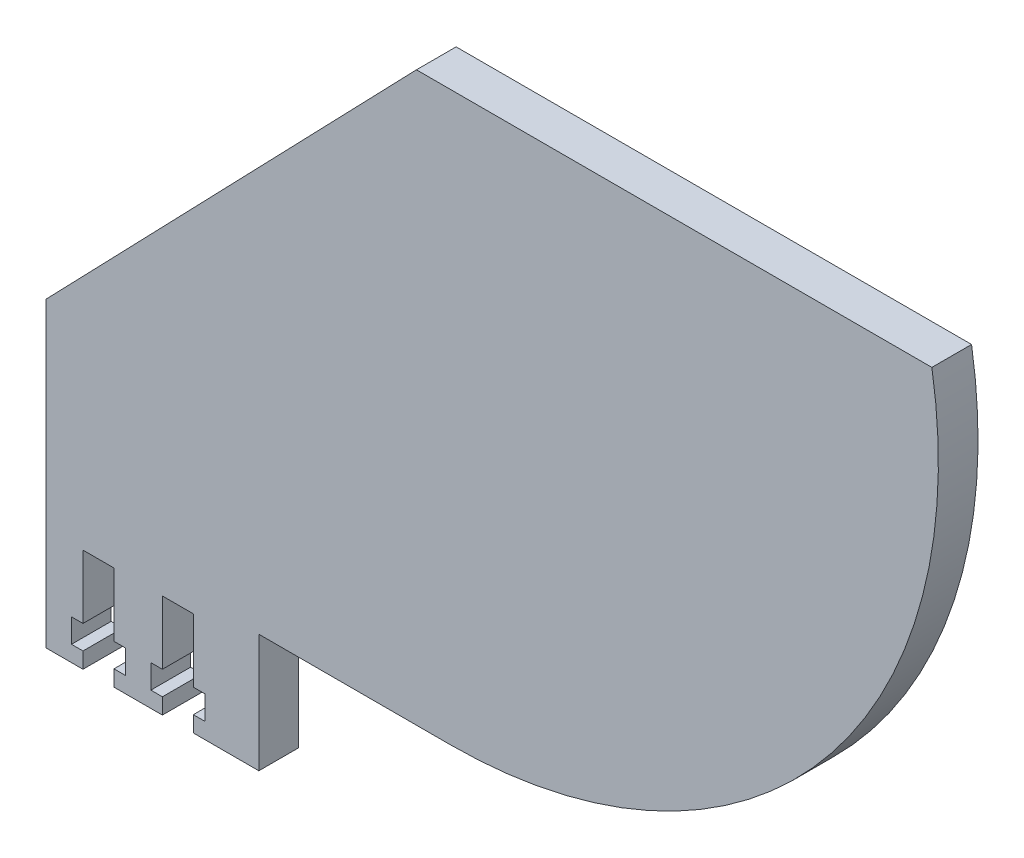
ISO-10303-21;
HEADER;
FILE_DESCRIPTION(('STEP AP214'),'2;1');
FILE_NAME('part.step','',(''),(''),'','','');
FILE_SCHEMA(('AUTOMOTIVE_DESIGN { 1 0 10303 214 1 1 1 1 }'));
ENDSEC;
DATA;
#1=APPLICATION_CONTEXT('core data for automotive mechanical design processes');
#2=APPLICATION_PROTOCOL_DEFINITION('international standard','automotive_design',2000,#1);
#3=PRODUCT_CONTEXT('',#1,'mechanical');
#4=PRODUCT('Part','Part','',(#3));
#5=PRODUCT_RELATED_PRODUCT_CATEGORY('part','',(#4));
#6=PRODUCT_DEFINITION_FORMATION('','',#4);
#7=PRODUCT_DEFINITION_CONTEXT('part definition',#1,'design');
#8=PRODUCT_DEFINITION('design','',#6,#7);
#9=PRODUCT_DEFINITION_SHAPE('','',#8);
#10=(LENGTH_UNIT() NAMED_UNIT(*) SI_UNIT(.MILLI.,.METRE.));
#11=(NAMED_UNIT(*) PLANE_ANGLE_UNIT() SI_UNIT($,.RADIAN.));
#12=(NAMED_UNIT(*) SI_UNIT($,.STERADIAN.) SOLID_ANGLE_UNIT());
#13=UNCERTAINTY_MEASURE_WITH_UNIT(LENGTH_MEASURE(1.E-05),#10,'distance_accuracy_value','');
#14=(GEOMETRIC_REPRESENTATION_CONTEXT(3) GLOBAL_UNCERTAINTY_ASSIGNED_CONTEXT((#13)) GLOBAL_UNIT_ASSIGNED_CONTEXT((#10,
#11,#12)) REPRESENTATION_CONTEXT('',''));
#15=CARTESIAN_POINT('',(0.,0.,0.));
#16=DIRECTION('',(0.,0.,1.));
#17=DIRECTION('',(1.,0.,0.));
#18=AXIS2_PLACEMENT_3D('',#15,#16,#17);
#19=CARTESIAN_POINT('',(-227.4824256817,-83.8915758699051,5.));
#20=DIRECTION('',(0.,1.,0.));
#21=DIRECTION('',(-1.,0.,0.));
#22=AXIS2_PLACEMENT_3D('',#19,#20,#21);
#23=PLANE('',#22);
#24=DIRECTION('',(1.,0.,0.));
#25=VECTOR('',#24,1.);
#26=CARTESIAN_POINT('',(-227.4824256817,-83.8915758699051,0.));
#27=LINE('',#26,#25);
#28=CARTESIAN_POINT('',(-218.9224256817,-83.8915758699051,0.));
#29=VERTEX_POINT('',#28);
#30=CARTESIAN_POINT('',(-212.8224256817,-83.8915758699051,0.));
#31=VERTEX_POINT('',#30);
#32=EDGE_CURVE('E256',#29,#31,#27,.T.);
#33=ORIENTED_EDGE('',*,*,#32,.T.);
#34=DIRECTION('',(0.,0.,1.));
#35=VECTOR('',#34,1.);
#36=CARTESIAN_POINT('',(-212.8224256817,-83.8915758699051,0.));
#37=LINE('',#36,#35);
#38=CARTESIAN_POINT('',(-212.8224256817,-83.8915758699051,5.));
#39=VERTEX_POINT('',#38);
#40=EDGE_CURVE('E238',#31,#39,#37,.T.);
#41=ORIENTED_EDGE('',*,*,#40,.T.);
#42=DIRECTION('',(1.,0.,0.));
#43=VECTOR('',#42,1.);
#44=CARTESIAN_POINT('',(-227.4824256817,-83.8915758699051,5.));
#45=LINE('',#44,#43);
#46=CARTESIAN_POINT('',(-218.9224256817,-83.8915758699051,5.));
#47=VERTEX_POINT('',#46);
#48=EDGE_CURVE('E346',#47,#39,#45,.T.);
#49=ORIENTED_EDGE('',*,*,#48,.F.);
#50=DIRECTION('',(0.,0.,1.));
#51=VECTOR('',#50,1.);
#52=CARTESIAN_POINT('',(-218.9224256817,-83.8915758699051,0.));
#53=LINE('',#52,#51);
#54=EDGE_CURVE('E263',#29,#47,#53,.T.);
#55=ORIENTED_EDGE('',*,*,#54,.F.);
#56=EDGE_LOOP('',(#33,#41,#49,#55));
#57=FACE_BOUND('',#56,.T.);
#58=ADVANCED_FACE('F35',(#57),#23,.F.);
#59=CARTESIAN_POINT('',(-227.4824256817,-83.8915758699051,0.));
#60=VERTEX_POINT('',#59);
#61=CARTESIAN_POINT('',(-222.8224256817,-83.8915758699051,0.));
#62=VERTEX_POINT('',#61);
#63=EDGE_CURVE('E264',#60,#62,#27,.T.);
#64=ORIENTED_EDGE('',*,*,#63,.T.);
#65=DIRECTION('',(0.,0.,1.));
#66=VECTOR('',#65,1.);
#67=CARTESIAN_POINT('',(-222.8224256817,-83.8915758699051,0.));
#68=LINE('',#67,#66);
#69=CARTESIAN_POINT('',(-222.8224256817,-83.8915758699051,5.));
#70=VERTEX_POINT('',#69);
#71=EDGE_CURVE('E350',#62,#70,#68,.T.);
#72=ORIENTED_EDGE('',*,*,#71,.T.);
#73=CARTESIAN_POINT('',(-227.4824256817,-83.8915758699051,5.));
#74=VERTEX_POINT('',#73);
#75=EDGE_CURVE('E348',#74,#70,#45,.T.);
#76=ORIENTED_EDGE('',*,*,#75,.F.);
#77=DIRECTION('',(0.,0.,-1.));
#78=VECTOR('',#77,1.);
#79=CARTESIAN_POINT('',(-227.4824256817,-83.8915758699051,5.));
#80=LINE('',#79,#78);
#81=EDGE_CURVE('E11',#74,#60,#80,.T.);
#82=ORIENTED_EDGE('',*,*,#81,.T.);
#83=EDGE_LOOP('',(#64,#72,#76,#82));
#84=FACE_BOUND('',#83,.T.);
#85=ADVANCED_FACE('F450',(#84),#23,.F.);
#86=CARTESIAN_POINT('',(-227.4824256817,-83.8915758699051,5.));
#87=DIRECTION('',(1.,0.,0.));
#88=DIRECTION('',(0.,0.,-1.));
#89=AXIS2_PLACEMENT_3D('',#86,#87,#88);
#90=PLANE('',#89);
#91=DIRECTION('',(0.,-1.,0.));
#92=VECTOR('',#91,1.);
#93=CARTESIAN_POINT('',(-227.4824256817,-83.8915758699051,0.));
#94=LINE('',#93,#92);
#95=CARTESIAN_POINT('',(-227.4824256817,-45.8486887400731,0.));
#96=VERTEX_POINT('',#95);
#97=EDGE_CURVE('E269',#96,#60,#94,.T.);
#98=ORIENTED_EDGE('',*,*,#97,.T.);
#99=ORIENTED_EDGE('',*,*,#81,.F.);
#100=DIRECTION('',(0.,-1.,0.));
#101=VECTOR('',#100,1.);
#102=CARTESIAN_POINT('',(-227.4824256817,-83.8915758699051,5.));
#103=LINE('',#102,#101);
#104=CARTESIAN_POINT('',(-227.4824256817,-45.8486887400731,5.));
#105=VERTEX_POINT('',#104);
#106=EDGE_CURVE('E282',#105,#74,#103,.T.);
#107=ORIENTED_EDGE('',*,*,#106,.F.);
#108=DIRECTION('',(0.,0.,-1.));
#109=VECTOR('',#108,1.);
#110=CARTESIAN_POINT('',(-227.4824256817,-45.8486887400731,5.));
#111=LINE('',#110,#109);
#112=EDGE_CURVE('E283',#105,#96,#111,.T.);
#113=ORIENTED_EDGE('',*,*,#112,.T.);
#114=EDGE_LOOP('',(#98,#99,#107,#113));
#115=FACE_BOUND('',#114,.T.);
#116=ADVANCED_FACE('F37',(#115),#90,.F.);
#117=CARTESIAN_POINT('',(-208.9224256817,-83.8915758699051,5.));
#118=VERTEX_POINT('',#117);
#119=CARTESIAN_POINT('',(-200.672425681694,-83.8915758699053,5.));
#120=VERTEX_POINT('',#119);
#121=EDGE_CURVE('E344',#118,#120,#45,.T.);
#122=ORIENTED_EDGE('',*,*,#121,.F.);
#123=DIRECTION('',(0.,0.,1.));
#124=VECTOR('',#123,1.);
#125=CARTESIAN_POINT('',(-208.9224256817,-83.8915758699051,0.));
#126=LINE('',#125,#124);
#127=CARTESIAN_POINT('',(-208.9224256817,-83.8915758699051,0.));
#128=VERTEX_POINT('',#127);
#129=EDGE_CURVE('E249',#128,#118,#126,.T.);
#130=ORIENTED_EDGE('',*,*,#129,.F.);
#131=CARTESIAN_POINT('',(-200.672425681694,-83.8915758699053,0.));
#132=VERTEX_POINT('',#131);
#133=EDGE_CURVE('E265',#128,#132,#27,.T.);
#134=ORIENTED_EDGE('',*,*,#133,.T.);
#135=DIRECTION('',(0.,0.,-1.));
#136=VECTOR('',#135,1.);
#137=CARTESIAN_POINT('',(-200.672425681694,-83.8915758699053,5.));
#138=LINE('',#137,#136);
#139=EDGE_CURVE('E43',#120,#132,#138,.T.);
#140=ORIENTED_EDGE('',*,*,#139,.F.);
#141=EDGE_LOOP('',(#122,#130,#134,#140));
#142=FACE_BOUND('',#141,.T.);
#143=ADVANCED_FACE('F357',(#142),#23,.F.);
#144=CARTESIAN_POINT('',(-200.672425681694,-83.8915758699053,5.));
#145=DIRECTION('',(-1.,0.,0.));
#146=DIRECTION('',(0.,-1.,0.));
#147=AXIS2_PLACEMENT_3D('',#144,#145,#146);
#148=PLANE('',#147);
#149=DIRECTION('',(0.,1.,0.));
#150=VECTOR('',#149,1.);
#151=CARTESIAN_POINT('',(-200.672425681694,-83.8915758699053,0.));
#152=LINE('',#151,#150);
#153=CARTESIAN_POINT('',(-200.672425681694,-68.9915758699057,0.));
#154=VERTEX_POINT('',#153);
#155=EDGE_CURVE('E268',#132,#154,#152,.T.);
#156=ORIENTED_EDGE('',*,*,#155,.T.);
#157=DIRECTION('',(0.,0.,-1.));
#158=VECTOR('',#157,1.);
#159=CARTESIAN_POINT('',(-200.672425681694,-68.9915758699057,5.));
#160=LINE('',#159,#158);
#161=CARTESIAN_POINT('',(-200.672425681694,-68.9915758699057,5.));
#162=VERTEX_POINT('',#161);
#163=EDGE_CURVE('E296',#162,#154,#160,.T.);
#164=ORIENTED_EDGE('',*,*,#163,.F.);
#165=DIRECTION('',(0.,1.,0.));
#166=VECTOR('',#165,1.);
#167=CARTESIAN_POINT('',(-200.672425681694,-83.8915758699053,5.));
#168=LINE('',#167,#166);
#169=EDGE_CURVE('E305',#120,#162,#168,.T.);
#170=ORIENTED_EDGE('',*,*,#169,.F.);
#171=ORIENTED_EDGE('',*,*,#139,.T.);
#172=EDGE_LOOP('',(#156,#164,#170,#171));
#173=FACE_BOUND('',#172,.T.);
#174=ADVANCED_FACE('F303',(#173),#148,.F.);
#175=CARTESIAN_POINT('',(-200.672425681694,-68.9915758699057,5.));
#176=DIRECTION('',(0.,1.,0.));
#177=DIRECTION('',(-1.,0.,0.));
#178=AXIS2_PLACEMENT_3D('',#175,#176,#177);
#179=PLANE('',#178);
#180=DIRECTION('',(1.,0.,0.));
#181=VECTOR('',#180,1.);
#182=CARTESIAN_POINT('',(-200.672425681694,-68.9915758699057,0.));
#183=LINE('',#182,#181);
#184=CARTESIAN_POINT('',(-176.574253232759,-68.9915758699057,0.));
#185=VERTEX_POINT('',#184);
#186=EDGE_CURVE('E274',#154,#185,#183,.T.);
#187=ORIENTED_EDGE('',*,*,#186,.T.);
#188=DIRECTION('',(0.,0.,-1.));
#189=VECTOR('',#188,1.);
#190=CARTESIAN_POINT('',(-176.574253232759,-68.9915758699057,5.));
#191=LINE('',#190,#189);
#192=CARTESIAN_POINT('',(-176.574253232759,-68.9915758699057,5.));
#193=VERTEX_POINT('',#192);
#194=EDGE_CURVE('E293',#193,#185,#191,.T.);
#195=ORIENTED_EDGE('',*,*,#194,.F.);
#196=DIRECTION('',(1.,0.,0.));
#197=VECTOR('',#196,1.);
#198=CARTESIAN_POINT('',(-200.672425681694,-68.9915758699057,5.));
#199=LINE('',#198,#197);
#200=EDGE_CURVE('E325',#162,#193,#199,.T.);
#201=ORIENTED_EDGE('',*,*,#200,.F.);
#202=ORIENTED_EDGE('',*,*,#163,.T.);
#203=EDGE_LOOP('',(#187,#195,#201,#202));
#204=FACE_BOUND('',#203,.T.);
#205=ADVANCED_FACE('F315',(#204),#179,.F.);
#206=CARTESIAN_POINT('',(-176.574253232759,-7.49157586990564,5.));
#207=DIRECTION('',(0.,0.,-1.));
#208=DIRECTION('',(-1.,0.,0.));
#209=AXIS2_PLACEMENT_3D('',#206,#207,#208);
#210=CYLINDRICAL_SURFACE('',#209,61.5000000000001);
#211=CARTESIAN_POINT('',(-176.574253232759,-7.49157586990564,0.));
#212=DIRECTION('',(0.,0.,1.));
#213=DIRECTION('',(1.,0.,0.));
#214=AXIS2_PLACEMENT_3D('',#211,#212,#213);
#215=CIRCLE('',#214,61.5000000000001);
#216=CARTESIAN_POINT('',(-115.892707438342,2.50842413009422,0.));
#217=VERTEX_POINT('',#216);
#218=EDGE_CURVE('E276',#185,#217,#215,.T.);
#219=ORIENTED_EDGE('',*,*,#218,.T.);
#220=DIRECTION('',(0.,0.,-1.));
#221=VECTOR('',#220,1.);
#222=CARTESIAN_POINT('',(-115.892707438342,2.50842413009422,5.));
#223=LINE('',#222,#221);
#224=CARTESIAN_POINT('',(-115.892707438342,2.50842413009422,5.));
#225=VERTEX_POINT('',#224);
#226=EDGE_CURVE('E290',#225,#217,#223,.T.);
#227=ORIENTED_EDGE('',*,*,#226,.F.);
#228=CARTESIAN_POINT('',(-176.574253232759,-7.49157586990564,5.));
#229=DIRECTION('',(0.,0.,1.));
#230=DIRECTION('',(1.,0.,0.));
#231=AXIS2_PLACEMENT_3D('',#228,#229,#230);
#232=CIRCLE('',#231,61.5000000000001);
#233=EDGE_CURVE('E321',#193,#225,#232,.T.);
#234=ORIENTED_EDGE('',*,*,#233,.F.);
#235=ORIENTED_EDGE('',*,*,#194,.T.);
#236=EDGE_LOOP('',(#219,#227,#234,#235));
#237=FACE_BOUND('',#236,.T.);
#238=ADVANCED_FACE('F319',(#237),#210,.T.);
#239=CARTESIAN_POINT('',(-180.821327590865,2.50842413009444,5.));
#240=DIRECTION('',(0.,-1.,0.));
#241=DIRECTION('',(1.,0.,0.));
#242=AXIS2_PLACEMENT_3D('',#239,#240,#241);
#243=PLANE('',#242);
#244=DIRECTION('',(-1.,0.,0.));
#245=VECTOR('',#244,1.);
#246=CARTESIAN_POINT('',(-180.821327590865,2.50842413009444,0.));
#247=LINE('',#246,#245);
#248=CARTESIAN_POINT('',(-180.821327590865,2.50842413009444,0.));
#249=VERTEX_POINT('',#248);
#250=EDGE_CURVE('E278',#217,#249,#247,.T.);
#251=ORIENTED_EDGE('',*,*,#250,.T.);
#252=DIRECTION('',(0.,0.,-1.));
#253=VECTOR('',#252,1.);
#254=CARTESIAN_POINT('',(-180.821327590865,2.50842413009444,5.));
#255=LINE('',#254,#253);
#256=CARTESIAN_POINT('',(-180.821327590865,2.50842413009444,5.));
#257=VERTEX_POINT('',#256);
#258=EDGE_CURVE('E286',#257,#249,#255,.T.);
#259=ORIENTED_EDGE('',*,*,#258,.F.);
#260=DIRECTION('',(-1.,0.,0.));
#261=VECTOR('',#260,1.);
#262=CARTESIAN_POINT('',(-180.821327590865,2.50842413009444,5.));
#263=LINE('',#262,#261);
#264=EDGE_CURVE('E324',#225,#257,#263,.T.);
#265=ORIENTED_EDGE('',*,*,#264,.F.);
#266=ORIENTED_EDGE('',*,*,#226,.T.);
#267=EDGE_LOOP('',(#251,#259,#265,#266));
#268=FACE_BOUND('',#267,.T.);
#269=ADVANCED_FACE('F814',(#268),#243,.F.);
#270=CARTESIAN_POINT('',(-180.821327590865,2.50842413009444,5.));
#271=DIRECTION('',(0.719613563334399,-0.694374768741758,0.));
#272=DIRECTION('',(0.694374768741758,0.719613563334399,0.));
#273=AXIS2_PLACEMENT_3D('',#270,#271,#272);
#274=PLANE('',#273);
#275=DIRECTION('',(-0.694374768741758,-0.719613563334399,0.));
#276=VECTOR('',#275,1.);
#277=CARTESIAN_POINT('',(-180.821327590865,2.50842413009444,0.));
#278=LINE('',#277,#276);
#279=EDGE_CURVE('E280',#249,#96,#278,.T.);
#280=ORIENTED_EDGE('',*,*,#279,.T.);
#281=ORIENTED_EDGE('',*,*,#112,.F.);
#282=DIRECTION('',(-0.694374768741758,-0.719613563334399,0.));
#283=VECTOR('',#282,1.);
#284=CARTESIAN_POINT('',(-180.821327590865,2.50842413009444,5.));
#285=LINE('',#284,#283);
#286=EDGE_CURVE('E287',#257,#105,#285,.T.);
#287=ORIENTED_EDGE('',*,*,#286,.F.);
#288=ORIENTED_EDGE('',*,*,#258,.T.);
#289=EDGE_LOOP('',(#280,#281,#287,#288));
#290=FACE_BOUND('',#289,.T.);
#291=ADVANCED_FACE('F339',(#290),#274,.F.);
#292=CARTESIAN_POINT('',(-176.574253232759,-7.49157586990564,5.));
#293=DIRECTION('',(0.,0.,1.));
#294=DIRECTION('',(1.,0.,0.));
#295=AXIS2_PLACEMENT_3D('',#292,#293,#294);
#296=PLANE('',#295);
#297=DIRECTION('',(0.,-1.,0.));
#298=VECTOR('',#297,1.);
#299=CARTESIAN_POINT('',(-212.8224256817,-83.8915758699051,5.));
#300=LINE('',#299,#298);
#301=CARTESIAN_POINT('',(-212.8224256817,-81.8915758699051,5.));
#302=VERTEX_POINT('',#301);
#303=EDGE_CURVE('E244',#302,#39,#300,.T.);
#304=ORIENTED_EDGE('',*,*,#303,.F.);
#305=DIRECTION('',(1.,0.,0.));
#306=VECTOR('',#305,1.);
#307=CARTESIAN_POINT('',(-212.8224256817,-81.8915758699051,5.));
#308=LINE('',#307,#306);
#309=CARTESIAN_POINT('',(-214.2724256817,-81.8915758699051,5.));
#310=VERTEX_POINT('',#309);
#311=EDGE_CURVE('E260',#310,#302,#308,.T.);
#312=ORIENTED_EDGE('',*,*,#311,.F.);
#313=DIRECTION('',(0.,-1.,0.));
#314=VECTOR('',#313,1.);
#315=CARTESIAN_POINT('',(-214.2724256817,-78.8915758699051,5.));
#316=LINE('',#315,#314);
#317=CARTESIAN_POINT('',(-214.2724256817,-78.8915758699051,5.));
#318=VERTEX_POINT('',#317);
#319=EDGE_CURVE('E757',#318,#310,#316,.T.);
#320=ORIENTED_EDGE('',*,*,#319,.F.);
#321=DIRECTION('',(-1.,0.,0.));
#322=VECTOR('',#321,1.);
#323=CARTESIAN_POINT('',(-212.8224256817,-78.8915758699051,5.));
#324=LINE('',#323,#322);
#325=CARTESIAN_POINT('',(-212.8224256817,-78.8915758699051,5.));
#326=VERTEX_POINT('',#325);
#327=EDGE_CURVE('E754',#326,#318,#324,.T.);
#328=ORIENTED_EDGE('',*,*,#327,.F.);
#329=DIRECTION('',(0.,-1.,0.));
#330=VECTOR('',#329,1.);
#331=CARTESIAN_POINT('',(-212.8224256817,-78.8915758699051,5.));
#332=LINE('',#331,#330);
#333=CARTESIAN_POINT('',(-212.8224256817,-70.8915758699051,5.));
#334=VERTEX_POINT('',#333);
#335=EDGE_CURVE('E751',#334,#326,#332,.T.);
#336=ORIENTED_EDGE('',*,*,#335,.F.);
#337=DIRECTION('',(-1.,0.,0.));
#338=VECTOR('',#337,1.);
#339=CARTESIAN_POINT('',(-212.8224256817,-70.8915758699051,5.));
#340=LINE('',#339,#338);
#341=CARTESIAN_POINT('',(-208.9224256817,-70.8915758699051,5.));
#342=VERTEX_POINT('',#341);
#343=EDGE_CURVE('E748',#342,#334,#340,.T.);
#344=ORIENTED_EDGE('',*,*,#343,.F.);
#345=DIRECTION('',(0.,1.,0.));
#346=VECTOR('',#345,1.);
#347=CARTESIAN_POINT('',(-208.9224256817,-78.8915758699051,5.));
#348=LINE('',#347,#346);
#349=CARTESIAN_POINT('',(-208.9224256817,-78.8915758699051,5.));
#350=VERTEX_POINT('',#349);
#351=EDGE_CURVE('E745',#350,#342,#348,.T.);
#352=ORIENTED_EDGE('',*,*,#351,.F.);
#353=DIRECTION('',(-1.,0.,0.));
#354=VECTOR('',#353,1.);
#355=CARTESIAN_POINT('',(-208.9224256817,-78.8915758699051,5.));
#356=LINE('',#355,#354);
#357=CARTESIAN_POINT('',(-207.4724256817,-78.8915758699051,5.));
#358=VERTEX_POINT('',#357);
#359=EDGE_CURVE('E739',#358,#350,#356,.T.);
#360=ORIENTED_EDGE('',*,*,#359,.F.);
#361=DIRECTION('',(0.,1.,0.));
#362=VECTOR('',#361,1.);
#363=CARTESIAN_POINT('',(-207.4724256817,-78.8915758699051,5.));
#364=LINE('',#363,#362);
#365=CARTESIAN_POINT('',(-207.4724256817,-81.8915758699051,5.));
#366=VERTEX_POINT('',#365);
#367=EDGE_CURVE('E737',#366,#358,#364,.T.);
#368=ORIENTED_EDGE('',*,*,#367,.F.);
#369=DIRECTION('',(1.,0.,0.));
#370=VECTOR('',#369,1.);
#371=CARTESIAN_POINT('',(-208.9224256817,-81.8915758699051,5.));
#372=LINE('',#371,#370);
#373=CARTESIAN_POINT('',(-208.9224256817,-81.8915758699051,5.));
#374=VERTEX_POINT('',#373);
#375=EDGE_CURVE('E731',#374,#366,#372,.T.);
#376=ORIENTED_EDGE('',*,*,#375,.F.);
#377=DIRECTION('',(0.,1.,0.));
#378=VECTOR('',#377,1.);
#379=CARTESIAN_POINT('',(-208.9224256817,-83.8915758699051,5.));
#380=LINE('',#379,#378);
#381=EDGE_CURVE('E355',#118,#374,#380,.T.);
#382=ORIENTED_EDGE('',*,*,#381,.F.);
#383=ORIENTED_EDGE('',*,*,#121,.T.);
#384=ORIENTED_EDGE('',*,*,#169,.T.);
#385=ORIENTED_EDGE('',*,*,#200,.T.);
#386=ORIENTED_EDGE('',*,*,#233,.T.);
#387=ORIENTED_EDGE('',*,*,#264,.T.);
#388=ORIENTED_EDGE('',*,*,#286,.T.);
#389=ORIENTED_EDGE('',*,*,#106,.T.);
#390=ORIENTED_EDGE('',*,*,#75,.T.);
#391=DIRECTION('',(0.,-1.,0.));
#392=VECTOR('',#391,1.);
#393=CARTESIAN_POINT('',(-222.8224256817,-83.8915758699051,5.));
#394=LINE('',#393,#392);
#395=CARTESIAN_POINT('',(-222.8224256817,-81.8915758699051,5.));
#396=VERTEX_POINT('',#395);
#397=EDGE_CURVE('E396',#396,#70,#394,.T.);
#398=ORIENTED_EDGE('',*,*,#397,.F.);
#399=DIRECTION('',(1.,0.,0.));
#400=VECTOR('',#399,1.);
#401=CARTESIAN_POINT('',(-222.8224256817,-81.8915758699051,5.));
#402=LINE('',#401,#400);
#403=CARTESIAN_POINT('',(-224.2724256817,-81.8915758699051,5.));
#404=VERTEX_POINT('',#403);
#405=EDGE_CURVE('E369',#404,#396,#402,.T.);
#406=ORIENTED_EDGE('',*,*,#405,.F.);
#407=DIRECTION('',(0.,-1.,0.));
#408=VECTOR('',#407,1.);
#409=CARTESIAN_POINT('',(-224.2724256817,-78.8915758699051,5.));
#410=LINE('',#409,#408);
#411=CARTESIAN_POINT('',(-224.2724256817,-78.8915758699051,5.));
#412=VERTEX_POINT('',#411);
#413=EDGE_CURVE('E422',#412,#404,#410,.T.);
#414=ORIENTED_EDGE('',*,*,#413,.F.);
#415=DIRECTION('',(-1.,0.,0.));
#416=VECTOR('',#415,1.);
#417=CARTESIAN_POINT('',(-222.8224256817,-78.8915758699051,5.));
#418=LINE('',#417,#416);
#419=CARTESIAN_POINT('',(-222.8224256817,-78.8915758699051,5.));
#420=VERTEX_POINT('',#419);
#421=EDGE_CURVE('E419',#420,#412,#418,.T.);
#422=ORIENTED_EDGE('',*,*,#421,.F.);
#423=DIRECTION('',(0.,-1.,0.));
#424=VECTOR('',#423,1.);
#425=CARTESIAN_POINT('',(-222.8224256817,-78.8915758699051,5.));
#426=LINE('',#425,#424);
#427=CARTESIAN_POINT('',(-222.8224256817,-70.8915758699051,5.));
#428=VERTEX_POINT('',#427);
#429=EDGE_CURVE('E416',#428,#420,#426,.T.);
#430=ORIENTED_EDGE('',*,*,#429,.F.);
#431=DIRECTION('',(-1.,0.,0.));
#432=VECTOR('',#431,1.);
#433=CARTESIAN_POINT('',(-222.8224256817,-70.8915758699051,5.));
#434=LINE('',#433,#432);
#435=CARTESIAN_POINT('',(-218.9224256817,-70.8915758699051,5.));
#436=VERTEX_POINT('',#435);
#437=EDGE_CURVE('E413',#436,#428,#434,.T.);
#438=ORIENTED_EDGE('',*,*,#437,.F.);
#439=DIRECTION('',(0.,1.,0.));
#440=VECTOR('',#439,1.);
#441=CARTESIAN_POINT('',(-218.9224256817,-78.8915758699051,5.));
#442=LINE('',#441,#440);
#443=CARTESIAN_POINT('',(-218.9224256817,-78.8915758699051,5.));
#444=VERTEX_POINT('',#443);
#445=EDGE_CURVE('E410',#444,#436,#442,.T.);
#446=ORIENTED_EDGE('',*,*,#445,.F.);
#447=DIRECTION('',(-1.,0.,0.));
#448=VECTOR('',#447,1.);
#449=CARTESIAN_POINT('',(-218.9224256817,-78.8915758699051,5.));
#450=LINE('',#449,#448);
#451=CARTESIAN_POINT('',(-217.4724256817,-78.8915758699051,5.));
#452=VERTEX_POINT('',#451);
#453=EDGE_CURVE('E407',#452,#444,#450,.T.);
#454=ORIENTED_EDGE('',*,*,#453,.F.);
#455=DIRECTION('',(0.,1.,0.));
#456=VECTOR('',#455,1.);
#457=CARTESIAN_POINT('',(-217.4724256817,-78.8915758699051,5.));
#458=LINE('',#457,#456);
#459=CARTESIAN_POINT('',(-217.4724256817,-81.8915758699051,5.));
#460=VERTEX_POINT('',#459);
#461=EDGE_CURVE('E404',#460,#452,#458,.T.);
#462=ORIENTED_EDGE('',*,*,#461,.F.);
#463=DIRECTION('',(1.,0.,0.));
#464=VECTOR('',#463,1.);
#465=CARTESIAN_POINT('',(-218.9224256817,-81.8915758699051,5.));
#466=LINE('',#465,#464);
#467=CARTESIAN_POINT('',(-218.9224256817,-81.8915758699051,5.));
#468=VERTEX_POINT('',#467);
#469=EDGE_CURVE('E401',#468,#460,#466,.T.);
#470=ORIENTED_EDGE('',*,*,#469,.F.);
#471=DIRECTION('',(0.,1.,0.));
#472=VECTOR('',#471,1.);
#473=CARTESIAN_POINT('',(-218.9224256817,-83.8915758699051,5.));
#474=LINE('',#473,#472);
#475=EDGE_CURVE('E398',#47,#468,#474,.T.);
#476=ORIENTED_EDGE('',*,*,#475,.F.);
#477=ORIENTED_EDGE('',*,*,#48,.T.);
#478=EDGE_LOOP('',(#304,#312,#320,#328,#336,#344,#352,#360,#368,#376,#382,#383,#384,#385,#386,
#387,#388,#389,#390,#398,#406,#414,#422,#430,#438,#446,#454,#462,#470,#476,#477));
#479=FACE_BOUND('',#478,.T.);
#480=ADVANCED_FACE('F333',(#479),#296,.T.);
#481=CARTESIAN_POINT('',(-176.574253232759,-7.49157586990564,0.));
#482=DIRECTION('',(0.,0.,1.));
#483=DIRECTION('',(1.,0.,0.));
#484=AXIS2_PLACEMENT_3D('',#481,#482,#483);
#485=PLANE('',#484);
#486=DIRECTION('',(1.,0.,0.));
#487=VECTOR('',#486,1.);
#488=CARTESIAN_POINT('',(-212.8224256817,-81.8915758699051,0.));
#489=LINE('',#488,#487);
#490=CARTESIAN_POINT('',(-214.2724256817,-81.8915758699051,0.));
#491=VERTEX_POINT('',#490);
#492=CARTESIAN_POINT('',(-212.8224256817,-81.8915758699051,0.));
#493=VERTEX_POINT('',#492);
#494=EDGE_CURVE('E250',#491,#493,#489,.T.);
#495=ORIENTED_EDGE('',*,*,#494,.T.);
#496=DIRECTION('',(0.,-1.,0.));
#497=VECTOR('',#496,1.);
#498=CARTESIAN_POINT('',(-212.8224256817,-83.8915758699051,0.));
#499=LINE('',#498,#497);
#500=EDGE_CURVE('E241',#493,#31,#499,.T.);
#501=ORIENTED_EDGE('',*,*,#500,.T.);
#502=ORIENTED_EDGE('',*,*,#32,.F.);
#503=DIRECTION('',(0.,1.,0.));
#504=VECTOR('',#503,1.);
#505=CARTESIAN_POINT('',(-218.9224256817,-83.8915758699051,0.));
#506=LINE('',#505,#504);
#507=CARTESIAN_POINT('',(-218.9224256817,-81.8915758699051,0.));
#508=VERTEX_POINT('',#507);
#509=EDGE_CURVE('E368',#29,#508,#506,.T.);
#510=ORIENTED_EDGE('',*,*,#509,.T.);
#511=DIRECTION('',(1.,0.,0.));
#512=VECTOR('',#511,1.);
#513=CARTESIAN_POINT('',(-218.9224256817,-81.8915758699051,0.));
#514=LINE('',#513,#512);
#515=CARTESIAN_POINT('',(-217.4724256817,-81.8915758699051,0.));
#516=VERTEX_POINT('',#515);
#517=EDGE_CURVE('E58',#508,#516,#514,.T.);
#518=ORIENTED_EDGE('',*,*,#517,.T.);
#519=DIRECTION('',(0.,1.,0.));
#520=VECTOR('',#519,1.);
#521=CARTESIAN_POINT('',(-217.4724256817,-78.8915758699051,0.));
#522=LINE('',#521,#520);
#523=CARTESIAN_POINT('',(-217.4724256817,-78.8915758699051,0.));
#524=VERTEX_POINT('',#523);
#525=EDGE_CURVE('E372',#516,#524,#522,.T.);
#526=ORIENTED_EDGE('',*,*,#525,.T.);
#527=DIRECTION('',(-1.,0.,0.));
#528=VECTOR('',#527,1.);
#529=CARTESIAN_POINT('',(-218.9224256817,-78.8915758699051,0.));
#530=LINE('',#529,#528);
#531=CARTESIAN_POINT('',(-218.9224256817,-78.8915758699051,0.));
#532=VERTEX_POINT('',#531);
#533=EDGE_CURVE('E375',#524,#532,#530,.T.);
#534=ORIENTED_EDGE('',*,*,#533,.T.);
#535=DIRECTION('',(0.,1.,0.));
#536=VECTOR('',#535,1.);
#537=CARTESIAN_POINT('',(-218.9224256817,-78.8915758699051,0.));
#538=LINE('',#537,#536);
#539=CARTESIAN_POINT('',(-218.9224256817,-70.8915758699051,0.));
#540=VERTEX_POINT('',#539);
#541=EDGE_CURVE('E378',#532,#540,#538,.T.);
#542=ORIENTED_EDGE('',*,*,#541,.T.);
#543=DIRECTION('',(-1.,0.,0.));
#544=VECTOR('',#543,1.);
#545=CARTESIAN_POINT('',(-222.8224256817,-70.8915758699051,0.));
#546=LINE('',#545,#544);
#547=CARTESIAN_POINT('',(-222.8224256817,-70.8915758699051,0.));
#548=VERTEX_POINT('',#547);
#549=EDGE_CURVE('E381',#540,#548,#546,.T.);
#550=ORIENTED_EDGE('',*,*,#549,.T.);
#551=DIRECTION('',(0.,-1.,0.));
#552=VECTOR('',#551,1.);
#553=CARTESIAN_POINT('',(-222.8224256817,-78.8915758699051,0.));
#554=LINE('',#553,#552);
#555=CARTESIAN_POINT('',(-222.8224256817,-78.8915758699051,0.));
#556=VERTEX_POINT('',#555);
#557=EDGE_CURVE('E384',#548,#556,#554,.T.);
#558=ORIENTED_EDGE('',*,*,#557,.T.);
#559=DIRECTION('',(-1.,0.,0.));
#560=VECTOR('',#559,1.);
#561=CARTESIAN_POINT('',(-222.8224256817,-78.8915758699051,0.));
#562=LINE('',#561,#560);
#563=CARTESIAN_POINT('',(-224.2724256817,-78.8915758699051,0.));
#564=VERTEX_POINT('',#563);
#565=EDGE_CURVE('E387',#556,#564,#562,.T.);
#566=ORIENTED_EDGE('',*,*,#565,.T.);
#567=DIRECTION('',(0.,-1.,0.));
#568=VECTOR('',#567,1.);
#569=CARTESIAN_POINT('',(-224.2724256817,-78.8915758699051,0.));
#570=LINE('',#569,#568);
#571=CARTESIAN_POINT('',(-224.2724256817,-81.8915758699051,0.));
#572=VERTEX_POINT('',#571);
#573=EDGE_CURVE('E390',#564,#572,#570,.T.);
#574=ORIENTED_EDGE('',*,*,#573,.T.);
#575=DIRECTION('',(1.,0.,0.));
#576=VECTOR('',#575,1.);
#577=CARTESIAN_POINT('',(-222.8224256817,-81.8915758699051,0.));
#578=LINE('',#577,#576);
#579=CARTESIAN_POINT('',(-222.8224256817,-81.8915758699051,0.));
#580=VERTEX_POINT('',#579);
#581=EDGE_CURVE('E393',#572,#580,#578,.T.);
#582=ORIENTED_EDGE('',*,*,#581,.T.);
#583=DIRECTION('',(0.,-1.,0.));
#584=VECTOR('',#583,1.);
#585=CARTESIAN_POINT('',(-222.8224256817,-83.8915758699051,0.));
#586=LINE('',#585,#584);
#587=EDGE_CURVE('E365',#580,#62,#586,.T.);
#588=ORIENTED_EDGE('',*,*,#587,.T.);
#589=ORIENTED_EDGE('',*,*,#63,.F.);
#590=ORIENTED_EDGE('',*,*,#97,.F.);
#591=ORIENTED_EDGE('',*,*,#279,.F.);
#592=ORIENTED_EDGE('',*,*,#250,.F.);
#593=ORIENTED_EDGE('',*,*,#218,.F.);
#594=ORIENTED_EDGE('',*,*,#186,.F.);
#595=ORIENTED_EDGE('',*,*,#155,.F.);
#596=ORIENTED_EDGE('',*,*,#133,.F.);
#597=DIRECTION('',(0.,1.,0.));
#598=VECTOR('',#597,1.);
#599=CARTESIAN_POINT('',(-208.9224256817,-83.8915758699051,0.));
#600=LINE('',#599,#598);
#601=CARTESIAN_POINT('',(-208.9224256817,-81.8915758699051,0.));
#602=VERTEX_POINT('',#601);
#603=EDGE_CURVE('E259',#128,#602,#600,.T.);
#604=ORIENTED_EDGE('',*,*,#603,.T.);
#605=DIRECTION('',(1.,0.,0.));
#606=VECTOR('',#605,1.);
#607=CARTESIAN_POINT('',(-208.9224256817,-81.8915758699051,0.));
#608=LINE('',#607,#606);
#609=CARTESIAN_POINT('',(-207.4724256817,-81.8915758699051,0.));
#610=VERTEX_POINT('',#609);
#611=EDGE_CURVE('E50',#602,#610,#608,.T.);
#612=ORIENTED_EDGE('',*,*,#611,.T.);
#613=DIRECTION('',(0.,1.,0.));
#614=VECTOR('',#613,1.);
#615=CARTESIAN_POINT('',(-207.4724256817,-78.8915758699051,0.));
#616=LINE('',#615,#614);
#617=CARTESIAN_POINT('',(-207.4724256817,-78.8915758699051,0.));
#618=VERTEX_POINT('',#617);
#619=EDGE_CURVE('E779',#610,#618,#616,.T.);
#620=ORIENTED_EDGE('',*,*,#619,.T.);
#621=DIRECTION('',(-1.,0.,0.));
#622=VECTOR('',#621,1.);
#623=CARTESIAN_POINT('',(-208.9224256817,-78.8915758699051,0.));
#624=LINE('',#623,#622);
#625=CARTESIAN_POINT('',(-208.9224256817,-78.8915758699051,0.));
#626=VERTEX_POINT('',#625);
#627=EDGE_CURVE('E782',#618,#626,#624,.T.);
#628=ORIENTED_EDGE('',*,*,#627,.T.);
#629=DIRECTION('',(0.,1.,0.));
#630=VECTOR('',#629,1.);
#631=CARTESIAN_POINT('',(-208.9224256817,-78.8915758699051,0.));
#632=LINE('',#631,#630);
#633=CARTESIAN_POINT('',(-208.9224256817,-70.8915758699051,0.));
#634=VERTEX_POINT('',#633);
#635=EDGE_CURVE('E788',#626,#634,#632,.T.);
#636=ORIENTED_EDGE('',*,*,#635,.T.);
#637=DIRECTION('',(-1.,0.,0.));
#638=VECTOR('',#637,1.);
#639=CARTESIAN_POINT('',(-212.8224256817,-70.8915758699051,0.));
#640=LINE('',#639,#638);
#641=CARTESIAN_POINT('',(-212.8224256817,-70.8915758699051,0.));
#642=VERTEX_POINT('',#641);
#643=EDGE_CURVE('E791',#634,#642,#640,.T.);
#644=ORIENTED_EDGE('',*,*,#643,.T.);
#645=DIRECTION('',(0.,-1.,0.));
#646=VECTOR('',#645,1.);
#647=CARTESIAN_POINT('',(-212.8224256817,-78.8915758699051,0.));
#648=LINE('',#647,#646);
#649=CARTESIAN_POINT('',(-212.8224256817,-78.8915758699051,0.));
#650=VERTEX_POINT('',#649);
#651=EDGE_CURVE('E794',#642,#650,#648,.T.);
#652=ORIENTED_EDGE('',*,*,#651,.T.);
#653=DIRECTION('',(-1.,0.,0.));
#654=VECTOR('',#653,1.);
#655=CARTESIAN_POINT('',(-212.8224256817,-78.8915758699051,0.));
#656=LINE('',#655,#654);
#657=CARTESIAN_POINT('',(-214.2724256817,-78.8915758699051,0.));
#658=VERTEX_POINT('',#657);
#659=EDGE_CURVE('E797',#650,#658,#656,.T.);
#660=ORIENTED_EDGE('',*,*,#659,.T.);
#661=DIRECTION('',(0.,-1.,0.));
#662=VECTOR('',#661,1.);
#663=CARTESIAN_POINT('',(-214.2724256817,-78.8915758699051,0.));
#664=LINE('',#663,#662);
#665=EDGE_CURVE('E800',#658,#491,#664,.T.);
#666=ORIENTED_EDGE('',*,*,#665,.T.);
#667=EDGE_LOOP('',(#495,#501,#502,#510,#518,#526,#534,#542,#550,#558,#566,#574,#582,#588,#589,
#590,#591,#592,#593,#594,#595,#596,#604,#612,#620,#628,#636,#644,#652,#660,#666));
#668=FACE_BOUND('',#667,.T.);
#669=ADVANCED_FACE('F254',(#668),#485,.F.);
#670=CARTESIAN_POINT('',(-222.8224256817,-83.8915758699051,0.));
#671=DIRECTION('',(-1.,0.,0.));
#672=DIRECTION('',(0.,0.,1.));
#673=AXIS2_PLACEMENT_3D('',#670,#671,#672);
#674=PLANE('',#673);
#675=ORIENTED_EDGE('',*,*,#397,.T.);
#676=ORIENTED_EDGE('',*,*,#71,.F.);
#677=ORIENTED_EDGE('',*,*,#587,.F.);
#678=DIRECTION('',(0.,0.,1.));
#679=VECTOR('',#678,1.);
#680=CARTESIAN_POINT('',(-222.8224256817,-81.8915758699051,0.));
#681=LINE('',#680,#679);
#682=EDGE_CURVE('E427',#580,#396,#681,.T.);
#683=ORIENTED_EDGE('',*,*,#682,.T.);
#684=EDGE_LOOP('',(#675,#676,#677,#683));
#685=FACE_BOUND('',#684,.T.);
#686=ADVANCED_FACE('F456',(#685),#674,.F.);
#687=CARTESIAN_POINT('',(-222.8224256817,-81.8915758699051,0.));
#688=DIRECTION('',(0.,-1.,0.));
#689=DIRECTION('',(0.,0.,-1.));
#690=AXIS2_PLACEMENT_3D('',#687,#688,#689);
#691=PLANE('',#690);
#692=ORIENTED_EDGE('',*,*,#405,.T.);
#693=ORIENTED_EDGE('',*,*,#682,.F.);
#694=ORIENTED_EDGE('',*,*,#581,.F.);
#695=DIRECTION('',(0.,0.,1.));
#696=VECTOR('',#695,1.);
#697=CARTESIAN_POINT('',(-224.2724256817,-81.8915758699051,0.));
#698=LINE('',#697,#696);
#699=EDGE_CURVE('E429',#572,#404,#698,.T.);
#700=ORIENTED_EDGE('',*,*,#699,.T.);
#701=EDGE_LOOP('',(#692,#693,#694,#700));
#702=FACE_BOUND('',#701,.T.);
#703=ADVANCED_FACE('F459',(#702),#691,.F.);
#704=CARTESIAN_POINT('',(-224.2724256817,-78.8915758699051,0.));
#705=DIRECTION('',(-1.,0.,0.));
#706=DIRECTION('',(0.,0.,1.));
#707=AXIS2_PLACEMENT_3D('',#704,#705,#706);
#708=PLANE('',#707);
#709=ORIENTED_EDGE('',*,*,#413,.T.);
#710=ORIENTED_EDGE('',*,*,#699,.F.);
#711=ORIENTED_EDGE('',*,*,#573,.F.);
#712=DIRECTION('',(0.,0.,1.));
#713=VECTOR('',#712,1.);
#714=CARTESIAN_POINT('',(-224.2724256817,-78.8915758699051,0.));
#715=LINE('',#714,#713);
#716=EDGE_CURVE('E431',#564,#412,#715,.T.);
#717=ORIENTED_EDGE('',*,*,#716,.T.);
#718=EDGE_LOOP('',(#709,#710,#711,#717));
#719=FACE_BOUND('',#718,.T.);
#720=ADVANCED_FACE('F462',(#719),#708,.F.);
#721=CARTESIAN_POINT('',(-222.8224256817,-78.8915758699051,0.));
#722=DIRECTION('',(0.,1.,0.));
#723=DIRECTION('',(0.,0.,1.));
#724=AXIS2_PLACEMENT_3D('',#721,#722,#723);
#725=PLANE('',#724);
#726=ORIENTED_EDGE('',*,*,#421,.T.);
#727=ORIENTED_EDGE('',*,*,#716,.F.);
#728=ORIENTED_EDGE('',*,*,#565,.F.);
#729=DIRECTION('',(0.,0.,1.));
#730=VECTOR('',#729,1.);
#731=CARTESIAN_POINT('',(-222.8224256817,-78.8915758699051,0.));
#732=LINE('',#731,#730);
#733=EDGE_CURVE('E433',#556,#420,#732,.T.);
#734=ORIENTED_EDGE('',*,*,#733,.T.);
#735=EDGE_LOOP('',(#726,#727,#728,#734));
#736=FACE_BOUND('',#735,.T.);
#737=ADVANCED_FACE('F467',(#736),#725,.F.);
#738=CARTESIAN_POINT('',(-222.8224256817,-78.8915758699051,0.));
#739=DIRECTION('',(-1.,0.,0.));
#740=DIRECTION('',(0.,0.,1.));
#741=AXIS2_PLACEMENT_3D('',#738,#739,#740);
#742=PLANE('',#741);
#743=ORIENTED_EDGE('',*,*,#429,.T.);
#744=ORIENTED_EDGE('',*,*,#733,.F.);
#745=ORIENTED_EDGE('',*,*,#557,.F.);
#746=DIRECTION('',(0.,0.,1.));
#747=VECTOR('',#746,1.);
#748=CARTESIAN_POINT('',(-222.8224256817,-70.8915758699051,0.));
#749=LINE('',#748,#747);
#750=EDGE_CURVE('E435',#548,#428,#749,.T.);
#751=ORIENTED_EDGE('',*,*,#750,.T.);
#752=EDGE_LOOP('',(#743,#744,#745,#751));
#753=FACE_BOUND('',#752,.T.);
#754=ADVANCED_FACE('F471',(#753),#742,.F.);
#755=CARTESIAN_POINT('',(-222.8224256817,-70.8915758699051,0.));
#756=DIRECTION('',(0.,1.,0.));
#757=DIRECTION('',(0.,0.,1.));
#758=AXIS2_PLACEMENT_3D('',#755,#756,#757);
#759=PLANE('',#758);
#760=ORIENTED_EDGE('',*,*,#437,.T.);
#761=ORIENTED_EDGE('',*,*,#750,.F.);
#762=ORIENTED_EDGE('',*,*,#549,.F.);
#763=DIRECTION('',(0.,0.,1.));
#764=VECTOR('',#763,1.);
#765=CARTESIAN_POINT('',(-218.9224256817,-70.8915758699051,0.));
#766=LINE('',#765,#764);
#767=EDGE_CURVE('E437',#540,#436,#766,.T.);
#768=ORIENTED_EDGE('',*,*,#767,.T.);
#769=EDGE_LOOP('',(#760,#761,#762,#768));
#770=FACE_BOUND('',#769,.T.);
#771=ADVANCED_FACE('F474',(#770),#759,.F.);
#772=CARTESIAN_POINT('',(-218.9224256817,-78.8915758699051,0.));
#773=DIRECTION('',(1.,0.,0.));
#774=DIRECTION('',(0.,0.,-1.));
#775=AXIS2_PLACEMENT_3D('',#772,#773,#774);
#776=PLANE('',#775);
#777=ORIENTED_EDGE('',*,*,#445,.T.);
#778=ORIENTED_EDGE('',*,*,#767,.F.);
#779=ORIENTED_EDGE('',*,*,#541,.F.);
#780=DIRECTION('',(0.,0.,1.));
#781=VECTOR('',#780,1.);
#782=CARTESIAN_POINT('',(-218.9224256817,-78.8915758699051,0.));
#783=LINE('',#782,#781);
#784=EDGE_CURVE('E439',#532,#444,#783,.T.);
#785=ORIENTED_EDGE('',*,*,#784,.T.);
#786=EDGE_LOOP('',(#777,#778,#779,#785));
#787=FACE_BOUND('',#786,.T.);
#788=ADVANCED_FACE('F479',(#787),#776,.F.);
#789=CARTESIAN_POINT('',(-218.9224256817,-78.8915758699051,0.));
#790=DIRECTION('',(0.,1.,0.));
#791=DIRECTION('',(0.,0.,1.));
#792=AXIS2_PLACEMENT_3D('',#789,#790,#791);
#793=PLANE('',#792);
#794=ORIENTED_EDGE('',*,*,#453,.T.);
#795=ORIENTED_EDGE('',*,*,#784,.F.);
#796=ORIENTED_EDGE('',*,*,#533,.F.);
#797=DIRECTION('',(0.,0.,1.));
#798=VECTOR('',#797,1.);
#799=CARTESIAN_POINT('',(-217.4724256817,-78.8915758699051,0.));
#800=LINE('',#799,#798);
#801=EDGE_CURVE('E441',#524,#452,#800,.T.);
#802=ORIENTED_EDGE('',*,*,#801,.T.);
#803=EDGE_LOOP('',(#794,#795,#796,#802));
#804=FACE_BOUND('',#803,.T.);
#805=ADVANCED_FACE('F483',(#804),#793,.F.);
#806=CARTESIAN_POINT('',(-217.4724256817,-78.8915758699051,0.));
#807=DIRECTION('',(1.,0.,0.));
#808=DIRECTION('',(0.,0.,-1.));
#809=AXIS2_PLACEMENT_3D('',#806,#807,#808);
#810=PLANE('',#809);
#811=ORIENTED_EDGE('',*,*,#461,.T.);
#812=ORIENTED_EDGE('',*,*,#801,.F.);
#813=ORIENTED_EDGE('',*,*,#525,.F.);
#814=DIRECTION('',(0.,0.,1.));
#815=VECTOR('',#814,1.);
#816=CARTESIAN_POINT('',(-217.4724256817,-81.8915758699051,0.));
#817=LINE('',#816,#815);
#818=EDGE_CURVE('E443',#516,#460,#817,.T.);
#819=ORIENTED_EDGE('',*,*,#818,.T.);
#820=EDGE_LOOP('',(#811,#812,#813,#819));
#821=FACE_BOUND('',#820,.T.);
#822=ADVANCED_FACE('F486',(#821),#810,.F.);
#823=CARTESIAN_POINT('',(-218.9224256817,-81.8915758699051,0.));
#824=DIRECTION('',(0.,-1.,0.));
#825=DIRECTION('',(0.,0.,-1.));
#826=AXIS2_PLACEMENT_3D('',#823,#824,#825);
#827=PLANE('',#826);
#828=ORIENTED_EDGE('',*,*,#469,.T.);
#829=ORIENTED_EDGE('',*,*,#818,.F.);
#830=ORIENTED_EDGE('',*,*,#517,.F.);
#831=DIRECTION('',(0.,0.,1.));
#832=VECTOR('',#831,1.);
#833=CARTESIAN_POINT('',(-218.9224256817,-81.8915758699051,0.));
#834=LINE('',#833,#832);
#835=EDGE_CURVE('E445',#508,#468,#834,.T.);
#836=ORIENTED_EDGE('',*,*,#835,.T.);
#837=EDGE_LOOP('',(#828,#829,#830,#836));
#838=FACE_BOUND('',#837,.T.);
#839=ADVANCED_FACE('F488',(#838),#827,.F.);
#840=CARTESIAN_POINT('',(-218.9224256817,-83.8915758699051,0.));
#841=DIRECTION('',(1.,0.,0.));
#842=DIRECTION('',(0.,0.,-1.));
#843=AXIS2_PLACEMENT_3D('',#840,#841,#842);
#844=PLANE('',#843);
#845=ORIENTED_EDGE('',*,*,#475,.T.);
#846=ORIENTED_EDGE('',*,*,#835,.F.);
#847=ORIENTED_EDGE('',*,*,#509,.F.);
#848=ORIENTED_EDGE('',*,*,#54,.T.);
#849=EDGE_LOOP('',(#845,#846,#847,#848));
#850=FACE_BOUND('',#849,.T.);
#851=ADVANCED_FACE('F489',(#850),#844,.F.);
#852=CARTESIAN_POINT('',(-212.8224256817,-83.8915758699051,0.));
#853=DIRECTION('',(-1.,0.,0.));
#854=DIRECTION('',(0.,0.,1.));
#855=AXIS2_PLACEMENT_3D('',#852,#853,#854);
#856=PLANE('',#855);
#857=ORIENTED_EDGE('',*,*,#303,.T.);
#858=ORIENTED_EDGE('',*,*,#40,.F.);
#859=ORIENTED_EDGE('',*,*,#500,.F.);
#860=DIRECTION('',(0.,0.,1.));
#861=VECTOR('',#860,1.);
#862=CARTESIAN_POINT('',(-212.8224256817,-81.8915758699051,0.));
#863=LINE('',#862,#861);
#864=EDGE_CURVE('E762',#493,#302,#863,.T.);
#865=ORIENTED_EDGE('',*,*,#864,.T.);
#866=EDGE_LOOP('',(#857,#858,#859,#865));
#867=FACE_BOUND('',#866,.T.);
#868=ADVANCED_FACE('F240',(#867),#856,.F.);
#869=CARTESIAN_POINT('',(-212.8224256817,-81.8915758699051,0.));
#870=DIRECTION('',(0.,-1.,0.));
#871=DIRECTION('',(0.,0.,-1.));
#872=AXIS2_PLACEMENT_3D('',#869,#870,#871);
#873=PLANE('',#872);
#874=ORIENTED_EDGE('',*,*,#311,.T.);
#875=ORIENTED_EDGE('',*,*,#864,.F.);
#876=ORIENTED_EDGE('',*,*,#494,.F.);
#877=DIRECTION('',(0.,0.,1.));
#878=VECTOR('',#877,1.);
#879=CARTESIAN_POINT('',(-214.2724256817,-81.8915758699051,0.));
#880=LINE('',#879,#878);
#881=EDGE_CURVE('E764',#491,#310,#880,.T.);
#882=ORIENTED_EDGE('',*,*,#881,.T.);
#883=EDGE_LOOP('',(#874,#875,#876,#882));
#884=FACE_BOUND('',#883,.T.);
#885=ADVANCED_FACE('F496',(#884),#873,.F.);
#886=CARTESIAN_POINT('',(-214.2724256817,-78.8915758699051,0.));
#887=DIRECTION('',(-1.,0.,0.));
#888=DIRECTION('',(0.,0.,1.));
#889=AXIS2_PLACEMENT_3D('',#886,#887,#888);
#890=PLANE('',#889);
#891=ORIENTED_EDGE('',*,*,#319,.T.);
#892=ORIENTED_EDGE('',*,*,#881,.F.);
#893=ORIENTED_EDGE('',*,*,#665,.F.);
#894=DIRECTION('',(0.,0.,1.));
#895=VECTOR('',#894,1.);
#896=CARTESIAN_POINT('',(-214.2724256817,-78.8915758699051,0.));
#897=LINE('',#896,#895);
#898=EDGE_CURVE('E766',#658,#318,#897,.T.);
#899=ORIENTED_EDGE('',*,*,#898,.T.);
#900=EDGE_LOOP('',(#891,#892,#893,#899));
#901=FACE_BOUND('',#900,.T.);
#902=ADVANCED_FACE('F639',(#901),#890,.F.);
#903=CARTESIAN_POINT('',(-212.8224256817,-78.8915758699051,0.));
#904=DIRECTION('',(0.,1.,0.));
#905=DIRECTION('',(0.,0.,1.));
#906=AXIS2_PLACEMENT_3D('',#903,#904,#905);
#907=PLANE('',#906);
#908=ORIENTED_EDGE('',*,*,#327,.T.);
#909=ORIENTED_EDGE('',*,*,#898,.F.);
#910=ORIENTED_EDGE('',*,*,#659,.F.);
#911=DIRECTION('',(0.,0.,1.));
#912=VECTOR('',#911,1.);
#913=CARTESIAN_POINT('',(-212.8224256817,-78.8915758699051,0.));
#914=LINE('',#913,#912);
#915=EDGE_CURVE('E768',#650,#326,#914,.T.);
#916=ORIENTED_EDGE('',*,*,#915,.T.);
#917=EDGE_LOOP('',(#908,#909,#910,#916));
#918=FACE_BOUND('',#917,.T.);
#919=ADVANCED_FACE('F649',(#918),#907,.F.);
#920=CARTESIAN_POINT('',(-212.8224256817,-78.8915758699051,0.));
#921=DIRECTION('',(-1.,0.,0.));
#922=DIRECTION('',(0.,0.,1.));
#923=AXIS2_PLACEMENT_3D('',#920,#921,#922);
#924=PLANE('',#923);
#925=ORIENTED_EDGE('',*,*,#335,.T.);
#926=ORIENTED_EDGE('',*,*,#915,.F.);
#927=ORIENTED_EDGE('',*,*,#651,.F.);
#928=DIRECTION('',(0.,0.,1.));
#929=VECTOR('',#928,1.);
#930=CARTESIAN_POINT('',(-212.8224256817,-70.8915758699051,0.));
#931=LINE('',#930,#929);
#932=EDGE_CURVE('E770',#642,#334,#931,.T.);
#933=ORIENTED_EDGE('',*,*,#932,.T.);
#934=EDGE_LOOP('',(#925,#926,#927,#933));
#935=FACE_BOUND('',#934,.T.);
#936=ADVANCED_FACE('F659',(#935),#924,.F.);
#937=CARTESIAN_POINT('',(-212.8224256817,-70.8915758699051,0.));
#938=DIRECTION('',(0.,1.,0.));
#939=DIRECTION('',(0.,0.,1.));
#940=AXIS2_PLACEMENT_3D('',#937,#938,#939);
#941=PLANE('',#940);
#942=ORIENTED_EDGE('',*,*,#343,.T.);
#943=ORIENTED_EDGE('',*,*,#932,.F.);
#944=ORIENTED_EDGE('',*,*,#643,.F.);
#945=DIRECTION('',(0.,0.,1.));
#946=VECTOR('',#945,1.);
#947=CARTESIAN_POINT('',(-208.9224256817,-70.8915758699051,0.));
#948=LINE('',#947,#946);
#949=EDGE_CURVE('E772',#634,#342,#948,.T.);
#950=ORIENTED_EDGE('',*,*,#949,.T.);
#951=EDGE_LOOP('',(#942,#943,#944,#950));
#952=FACE_BOUND('',#951,.T.);
#953=ADVANCED_FACE('F669',(#952),#941,.F.);
#954=CARTESIAN_POINT('',(-208.9224256817,-78.8915758699051,0.));
#955=DIRECTION('',(1.,0.,0.));
#956=DIRECTION('',(0.,0.,-1.));
#957=AXIS2_PLACEMENT_3D('',#954,#955,#956);
#958=PLANE('',#957);
#959=ORIENTED_EDGE('',*,*,#351,.T.);
#960=ORIENTED_EDGE('',*,*,#949,.F.);
#961=ORIENTED_EDGE('',*,*,#635,.F.);
#962=DIRECTION('',(0.,0.,1.));
#963=VECTOR('',#962,1.);
#964=CARTESIAN_POINT('',(-208.9224256817,-78.8915758699051,0.));
#965=LINE('',#964,#963);
#966=EDGE_CURVE('E774',#626,#350,#965,.T.);
#967=ORIENTED_EDGE('',*,*,#966,.T.);
#968=EDGE_LOOP('',(#959,#960,#961,#967));
#969=FACE_BOUND('',#968,.T.);
#970=ADVANCED_FACE('F679',(#969),#958,.F.);
#971=CARTESIAN_POINT('',(-208.9224256817,-78.8915758699051,0.));
#972=DIRECTION('',(0.,1.,0.));
#973=DIRECTION('',(0.,0.,1.));
#974=AXIS2_PLACEMENT_3D('',#971,#972,#973);
#975=PLANE('',#974);
#976=ORIENTED_EDGE('',*,*,#359,.T.);
#977=ORIENTED_EDGE('',*,*,#966,.F.);
#978=ORIENTED_EDGE('',*,*,#627,.F.);
#979=DIRECTION('',(0.,0.,1.));
#980=VECTOR('',#979,1.);
#981=CARTESIAN_POINT('',(-207.4724256817,-78.8915758699051,0.));
#982=LINE('',#981,#980);
#983=EDGE_CURVE('E776',#618,#358,#982,.T.);
#984=ORIENTED_EDGE('',*,*,#983,.T.);
#985=EDGE_LOOP('',(#976,#977,#978,#984));
#986=FACE_BOUND('',#985,.T.);
#987=ADVANCED_FACE('F689',(#986),#975,.F.);
#988=CARTESIAN_POINT('',(-207.4724256817,-78.8915758699051,0.));
#989=DIRECTION('',(1.,0.,0.));
#990=DIRECTION('',(0.,0.,-1.));
#991=AXIS2_PLACEMENT_3D('',#988,#989,#990);
#992=PLANE('',#991);
#993=ORIENTED_EDGE('',*,*,#367,.T.);
#994=ORIENTED_EDGE('',*,*,#983,.F.);
#995=ORIENTED_EDGE('',*,*,#619,.F.);
#996=DIRECTION('',(0.,0.,1.));
#997=VECTOR('',#996,1.);
#998=CARTESIAN_POINT('',(-207.4724256817,-81.8915758699051,0.));
#999=LINE('',#998,#997);
#1000=EDGE_CURVE('E361',#610,#366,#999,.T.);
#1001=ORIENTED_EDGE('',*,*,#1000,.T.);
#1002=EDGE_LOOP('',(#993,#994,#995,#1001));
#1003=FACE_BOUND('',#1002,.T.);
#1004=ADVANCED_FACE('F699',(#1003),#992,.F.);
#1005=CARTESIAN_POINT('',(-208.9224256817,-81.8915758699051,0.));
#1006=DIRECTION('',(0.,-1.,0.));
#1007=DIRECTION('',(0.,0.,-1.));
#1008=AXIS2_PLACEMENT_3D('',#1005,#1006,#1007);
#1009=PLANE('',#1008);
#1010=ORIENTED_EDGE('',*,*,#375,.T.);
#1011=ORIENTED_EDGE('',*,*,#1000,.F.);
#1012=ORIENTED_EDGE('',*,*,#611,.F.);
#1013=DIRECTION('',(0.,0.,1.));
#1014=VECTOR('',#1013,1.);
#1015=CARTESIAN_POINT('',(-208.9224256817,-81.8915758699051,0.));
#1016=LINE('',#1015,#1014);
#1017=EDGE_CURVE('E359',#602,#374,#1016,.T.);
#1018=ORIENTED_EDGE('',*,*,#1017,.T.);
#1019=EDGE_LOOP('',(#1010,#1011,#1012,#1018));
#1020=FACE_BOUND('',#1019,.T.);
#1021=ADVANCED_FACE('F709',(#1020),#1009,.F.);
#1022=CARTESIAN_POINT('',(-208.9224256817,-83.8915758699051,0.));
#1023=DIRECTION('',(1.,0.,0.));
#1024=DIRECTION('',(0.,0.,-1.));
#1025=AXIS2_PLACEMENT_3D('',#1022,#1023,#1024);
#1026=PLANE('',#1025);
#1027=ORIENTED_EDGE('',*,*,#381,.T.);
#1028=ORIENTED_EDGE('',*,*,#1017,.F.);
#1029=ORIENTED_EDGE('',*,*,#603,.F.);
#1030=ORIENTED_EDGE('',*,*,#129,.T.);
#1031=EDGE_LOOP('',(#1027,#1028,#1029,#1030));
#1032=FACE_BOUND('',#1031,.T.);
#1033=ADVANCED_FACE('F719',(#1032),#1026,.F.);
#1034=CLOSED_SHELL('',(#58,#85,#116,#143,#174,#205,#238,#269,#291,#480,#669,#686,#703,#720,#737,
#754,#771,#788,#805,#822,#839,#851,#868,#885,#902,#919,#936,#953,#970,#987,#1004,#1021,#1033));
#1035=MANIFOLD_SOLID_BREP('B2',#1034);
#1036=ADVANCED_BREP_SHAPE_REPRESENTATION('',(#18,#1035),#14);
#1037=SHAPE_DEFINITION_REPRESENTATION(#9,#1036);
ENDSEC;
END-ISO-10303-21;
